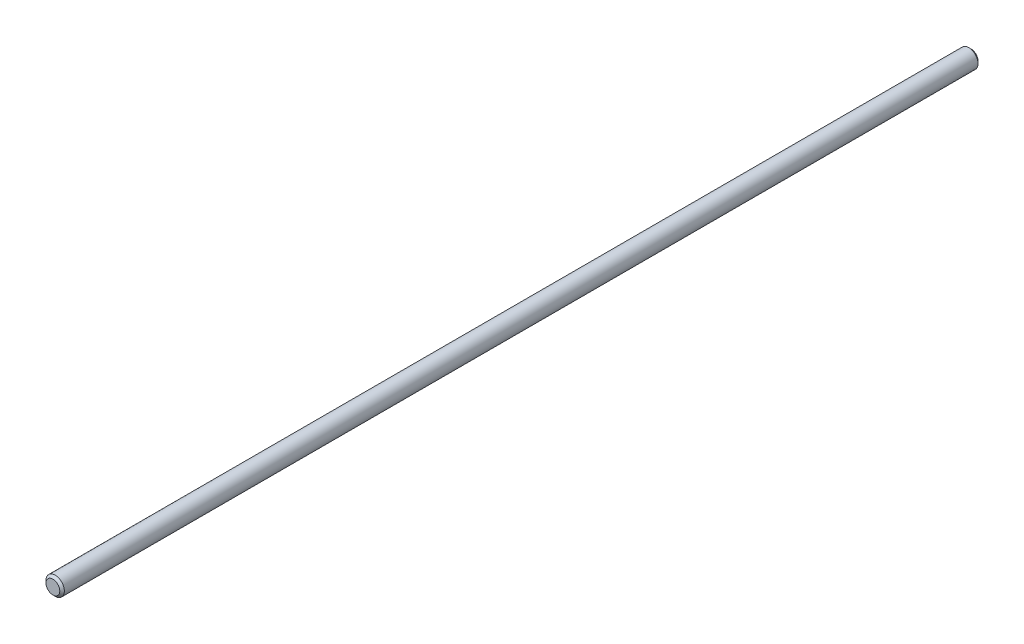
ISO-10303-21;
HEADER;
FILE_DESCRIPTION(('STEP AP214'),'2;1');
FILE_NAME('part.step','',(''),(''),'','','');
FILE_SCHEMA(('AUTOMOTIVE_DESIGN { 1 0 10303 214 1 1 1 1 }'));
ENDSEC;
DATA;
#1=APPLICATION_CONTEXT('core data for automotive mechanical design processes');
#2=APPLICATION_PROTOCOL_DEFINITION('international standard','automotive_design',2000,#1);
#3=PRODUCT_CONTEXT('',#1,'mechanical');
#4=PRODUCT('Part','Part','',(#3));
#5=PRODUCT_RELATED_PRODUCT_CATEGORY('part','',(#4));
#6=PRODUCT_DEFINITION_FORMATION('','',#4);
#7=PRODUCT_DEFINITION_CONTEXT('part definition',#1,'design');
#8=PRODUCT_DEFINITION('design','',#6,#7);
#9=PRODUCT_DEFINITION_SHAPE('','',#8);
#10=(LENGTH_UNIT() NAMED_UNIT(*) SI_UNIT(.MILLI.,.METRE.));
#11=(NAMED_UNIT(*) PLANE_ANGLE_UNIT() SI_UNIT($,.RADIAN.));
#12=(NAMED_UNIT(*) SI_UNIT($,.STERADIAN.) SOLID_ANGLE_UNIT());
#13=UNCERTAINTY_MEASURE_WITH_UNIT(LENGTH_MEASURE(1.E-05),#10,'distance_accuracy_value','');
#14=(GEOMETRIC_REPRESENTATION_CONTEXT(3) GLOBAL_UNCERTAINTY_ASSIGNED_CONTEXT((#13)) GLOBAL_UNIT_ASSIGNED_CONTEXT((#10,
#11,#12)) REPRESENTATION_CONTEXT('',''));
#15=CARTESIAN_POINT('',(0.,0.,0.));
#16=DIRECTION('',(0.,0.,1.));
#17=DIRECTION('',(1.,0.,0.));
#18=AXIS2_PLACEMENT_3D('',#15,#16,#17);
#19=CARTESIAN_POINT('',(0.,0.,400.));
#20=DIRECTION('',(0.,0.,-1.));
#21=DIRECTION('',(-1.,0.,0.));
#22=AXIS2_PLACEMENT_3D('',#19,#20,#21);
#23=CYLINDRICAL_SURFACE('',#22,4.);
#24=CARTESIAN_POINT('',(0.,0.,399.));
#25=DIRECTION('',(0.,0.,1.));
#26=DIRECTION('',(1.,0.,0.));
#27=AXIS2_PLACEMENT_3D('',#24,#25,#26);
#28=CIRCLE('',#27,4.);
#29=CARTESIAN_POINT('',(4.,0.,399.));
#30=VERTEX_POINT('',#29);
#31=EDGE_CURVE('E38',#30,#30,#28,.F.);
#32=ORIENTED_EDGE('',*,*,#31,.T.);
#33=EDGE_LOOP('',(#32));
#34=FACE_BOUND('',#33,.T.);
#35=CARTESIAN_POINT('',(0.,0.,1.00000000000006));
#36=DIRECTION('',(0.,0.,1.));
#37=DIRECTION('',(1.,0.,0.));
#38=AXIS2_PLACEMENT_3D('',#35,#36,#37);
#39=CIRCLE('',#38,4.);
#40=CARTESIAN_POINT('',(4.,0.,1.00000000000006));
#41=VERTEX_POINT('',#40);
#42=EDGE_CURVE('E42',#41,#41,#39,.T.);
#43=ORIENTED_EDGE('',*,*,#42,.T.);
#44=EDGE_LOOP('',(#43));
#45=FACE_BOUND('',#44,.T.);
#46=ADVANCED_FACE('F31',(#34,#45),#23,.T.);
#47=CARTESIAN_POINT('',(0.,0.,400.));
#48=DIRECTION('',(0.,0.,1.));
#49=DIRECTION('',(1.,0.,0.));
#50=AXIS2_PLACEMENT_3D('',#47,#48,#49);
#51=PLANE('',#50);
#52=CARTESIAN_POINT('',(0.,0.,400.));
#53=DIRECTION('',(0.,0.,1.));
#54=DIRECTION('',(1.,0.,0.));
#55=AXIS2_PLACEMENT_3D('',#52,#53,#54);
#56=CIRCLE('',#55,2.99999999999995);
#57=CARTESIAN_POINT('',(2.99999999999995,0.,400.));
#58=VERTEX_POINT('',#57);
#59=EDGE_CURVE('E46',#58,#58,#56,.T.);
#60=ORIENTED_EDGE('',*,*,#59,.T.);
#61=EDGE_LOOP('',(#60));
#62=FACE_BOUND('',#61,.T.);
#63=ADVANCED_FACE('F52',(#62),#51,.T.);
#64=CARTESIAN_POINT('',(0.,0.,0.));
#65=DIRECTION('',(0.,0.,1.));
#66=DIRECTION('',(1.,0.,0.));
#67=AXIS2_PLACEMENT_3D('',#64,#65,#66);
#68=PLANE('',#67);
#69=CARTESIAN_POINT('',(0.,0.,0.));
#70=DIRECTION('',(0.,0.,1.));
#71=DIRECTION('',(1.,0.,0.));
#72=AXIS2_PLACEMENT_3D('',#69,#70,#71);
#73=CIRCLE('',#72,2.99999999999995);
#74=CARTESIAN_POINT('',(2.99999999999995,0.,0.));
#75=VERTEX_POINT('',#74);
#76=EDGE_CURVE('E10',#75,#75,#73,.F.);
#77=ORIENTED_EDGE('',*,*,#76,.T.);
#78=EDGE_LOOP('',(#77));
#79=FACE_BOUND('',#78,.T.);
#80=ADVANCED_FACE('F56',(#79),#68,.F.);
#81=CARTESIAN_POINT('',(0.,0.,400.));
#82=DIRECTION('',(0.,0.,-1.));
#83=DIRECTION('',(-1.,0.,0.));
#84=AXIS2_PLACEMENT_3D('',#81,#82,#83);
#85=CONICAL_SURFACE('',#84,2.99999999999995,0.785398163397447);
#86=ORIENTED_EDGE('',*,*,#31,.F.);
#87=EDGE_LOOP('',(#86));
#88=FACE_BOUND('',#87,.T.);
#89=ORIENTED_EDGE('',*,*,#59,.F.);
#90=EDGE_LOOP('',(#89));
#91=FACE_BOUND('',#90,.T.);
#92=ADVANCED_FACE('F54',(#88,#91),#85,.T.);
#93=CARTESIAN_POINT('',(0.,0.,1.00000000000006));
#94=DIRECTION('',(0.,0.,1.));
#95=DIRECTION('',(1.,0.,0.));
#96=AXIS2_PLACEMENT_3D('',#93,#94,#95);
#97=CONICAL_SURFACE('',#96,4.,0.785398163397447);
#98=ORIENTED_EDGE('',*,*,#76,.F.);
#99=EDGE_LOOP('',(#98));
#100=FACE_BOUND('',#99,.T.);
#101=ORIENTED_EDGE('',*,*,#42,.F.);
#102=EDGE_LOOP('',(#101));
#103=FACE_BOUND('',#102,.T.);
#104=ADVANCED_FACE('F33',(#100,#103),#97,.T.);
#105=CLOSED_SHELL('',(#46,#63,#80,#92,#104));
#106=MANIFOLD_SOLID_BREP('B2',#105);
#107=ADVANCED_BREP_SHAPE_REPRESENTATION('',(#18,#106),#14);
#108=SHAPE_DEFINITION_REPRESENTATION(#9,#107);
ENDSEC;
END-ISO-10303-21;
